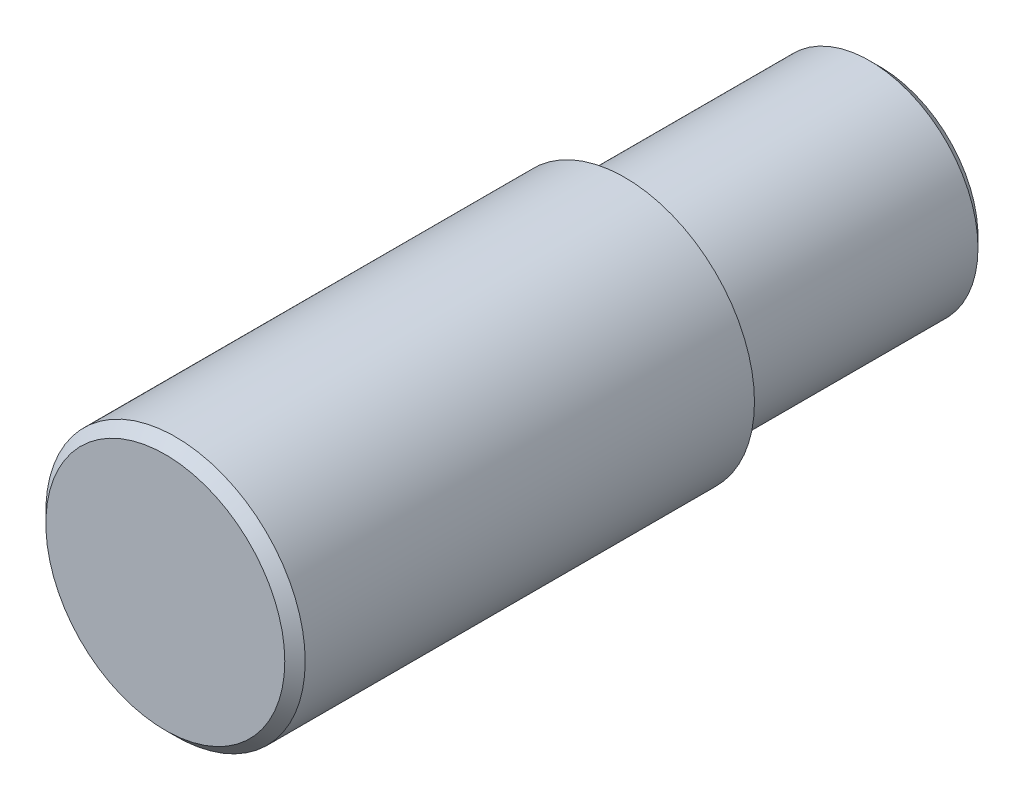
ISO-10303-21;
HEADER;
FILE_DESCRIPTION(('STEP AP214'),'2;1');
FILE_NAME('part.step','',(''),(''),'','','');
FILE_SCHEMA(('AUTOMOTIVE_DESIGN { 1 0 10303 214 1 1 1 1 }'));
ENDSEC;
DATA;
#1=APPLICATION_CONTEXT('core data for automotive mechanical design processes');
#2=APPLICATION_PROTOCOL_DEFINITION('international standard','automotive_design',2000,#1);
#3=PRODUCT_CONTEXT('',#1,'mechanical');
#4=PRODUCT('Part','Part','',(#3));
#5=PRODUCT_RELATED_PRODUCT_CATEGORY('part','',(#4));
#6=PRODUCT_DEFINITION_FORMATION('','',#4);
#7=PRODUCT_DEFINITION_CONTEXT('part definition',#1,'design');
#8=PRODUCT_DEFINITION('design','',#6,#7);
#9=PRODUCT_DEFINITION_SHAPE('','',#8);
#10=(LENGTH_UNIT() NAMED_UNIT(*) SI_UNIT(.MILLI.,.METRE.));
#11=(NAMED_UNIT(*) PLANE_ANGLE_UNIT() SI_UNIT($,.RADIAN.));
#12=(NAMED_UNIT(*) SI_UNIT($,.STERADIAN.) SOLID_ANGLE_UNIT());
#13=UNCERTAINTY_MEASURE_WITH_UNIT(LENGTH_MEASURE(1.E-05),#10,'distance_accuracy_value','');
#14=(GEOMETRIC_REPRESENTATION_CONTEXT(3) GLOBAL_UNCERTAINTY_ASSIGNED_CONTEXT((#13)) GLOBAL_UNIT_ASSIGNED_CONTEXT((#10,
#11,#12)) REPRESENTATION_CONTEXT('',''));
#15=CARTESIAN_POINT('',(0.,0.,0.));
#16=DIRECTION('',(0.,0.,1.));
#17=DIRECTION('',(1.,0.,0.));
#18=AXIS2_PLACEMENT_3D('',#15,#16,#17);
#19=CARTESIAN_POINT('',(0.,0.,45.));
#20=DIRECTION('',(0.,0.,-1.));
#21=DIRECTION('',(-1.,0.,0.));
#22=AXIS2_PLACEMENT_3D('',#19,#20,#21);
#23=CYLINDRICAL_SURFACE('',#22,12.7);
#24=CARTESIAN_POINT('',(0.,0.,44.));
#25=DIRECTION('',(0.,0.,1.));
#26=DIRECTION('',(1.,0.,0.));
#27=AXIS2_PLACEMENT_3D('',#24,#25,#26);
#28=CIRCLE('',#27,12.7);
#29=CARTESIAN_POINT('',(12.7,0.,44.));
#30=VERTEX_POINT('',#29);
#31=EDGE_CURVE('E10',#30,#30,#28,.F.);
#32=ORIENTED_EDGE('',*,*,#31,.T.);
#33=EDGE_LOOP('',(#32));
#34=FACE_BOUND('',#33,.T.);
#35=CARTESIAN_POINT('',(0.,0.,0.));
#36=DIRECTION('',(0.,0.,1.));
#37=DIRECTION('',(1.,0.,0.));
#38=AXIS2_PLACEMENT_3D('',#35,#36,#37);
#39=CIRCLE('',#38,12.7);
#40=CARTESIAN_POINT('',(12.7,0.,0.));
#41=VERTEX_POINT('',#40);
#42=EDGE_CURVE('E72',#41,#41,#39,.T.);
#43=ORIENTED_EDGE('',*,*,#42,.T.);
#44=EDGE_LOOP('',(#43));
#45=FACE_BOUND('',#44,.T.);
#46=ADVANCED_FACE('F45',(#34,#45),#23,.T.);
#47=CARTESIAN_POINT('',(0.,0.,45.));
#48=DIRECTION('',(0.,0.,1.));
#49=DIRECTION('',(1.,0.,0.));
#50=AXIS2_PLACEMENT_3D('',#47,#48,#49);
#51=PLANE('',#50);
#52=CARTESIAN_POINT('',(0.,0.,45.));
#53=DIRECTION('',(0.,0.,1.));
#54=DIRECTION('',(1.,0.,0.));
#55=AXIS2_PLACEMENT_3D('',#52,#53,#54);
#56=CIRCLE('',#55,11.7000000000001);
#57=CARTESIAN_POINT('',(11.7000000000001,0.,45.));
#58=VERTEX_POINT('',#57);
#59=EDGE_CURVE('E53',#58,#58,#56,.T.);
#60=ORIENTED_EDGE('',*,*,#59,.T.);
#61=EDGE_LOOP('',(#60));
#62=FACE_BOUND('',#61,.T.);
#63=ADVANCED_FACE('F80',(#62),#51,.T.);
#64=CARTESIAN_POINT('',(0.,0.,0.));
#65=DIRECTION('',(0.,0.,1.));
#66=DIRECTION('',(1.,0.,0.));
#67=AXIS2_PLACEMENT_3D('',#64,#65,#66);
#68=PLANE('',#67);
#69=CARTESIAN_POINT('',(0.,0.,0.));
#70=DIRECTION('',(0.,0.,1.));
#71=DIRECTION('',(1.,0.,0.));
#72=AXIS2_PLACEMENT_3D('',#69,#70,#71);
#73=CIRCLE('',#72,11.59);
#74=CARTESIAN_POINT('',(11.59,0.,0.));
#75=VERTEX_POINT('',#74);
#76=EDGE_CURVE('E66',#75,#75,#73,.T.);
#77=ORIENTED_EDGE('',*,*,#76,.T.);
#78=EDGE_LOOP('',(#77));
#79=FACE_BOUND('',#78,.T.);
#80=ORIENTED_EDGE('',*,*,#42,.F.);
#81=EDGE_LOOP('',(#80));
#82=FACE_BOUND('',#81,.T.);
#83=ADVANCED_FACE('F77',(#79,#82),#68,.F.);
#84=CARTESIAN_POINT('',(0.,0.,-25.));
#85=DIRECTION('',(0.,0.,1.));
#86=DIRECTION('',(1.,0.,0.));
#87=AXIS2_PLACEMENT_3D('',#84,#85,#86);
#88=CYLINDRICAL_SURFACE('',#87,10.59);
#89=CARTESIAN_POINT('',(0.,0.,-24.));
#90=DIRECTION('',(0.,0.,-1.));
#91=DIRECTION('',(-1.,0.,0.));
#92=AXIS2_PLACEMENT_3D('',#89,#90,#91);
#93=CIRCLE('',#92,10.59);
#94=CARTESIAN_POINT('',(-10.59,0.,-24.));
#95=VERTEX_POINT('',#94);
#96=EDGE_CURVE('E57',#95,#95,#93,.F.);
#97=ORIENTED_EDGE('',*,*,#96,.T.);
#98=EDGE_LOOP('',(#97));
#99=FACE_BOUND('',#98,.T.);
#100=CARTESIAN_POINT('',(0.,0.,-1.));
#101=DIRECTION('',(0.,0.,1.));
#102=DIRECTION('',(1.,0.,0.));
#103=AXIS2_PLACEMENT_3D('',#100,#101,#102);
#104=CIRCLE('',#103,10.59);
#105=CARTESIAN_POINT('',(10.59,0.,-1.));
#106=VERTEX_POINT('',#105);
#107=EDGE_CURVE('E69',#106,#106,#104,.F.);
#108=ORIENTED_EDGE('',*,*,#107,.T.);
#109=EDGE_LOOP('',(#108));
#110=FACE_BOUND('',#109,.T.);
#111=ADVANCED_FACE('F79',(#99,#110),#88,.T.);
#112=CARTESIAN_POINT('',(0.,0.,-25.));
#113=DIRECTION('',(0.,0.,-1.));
#114=DIRECTION('',(-1.,0.,0.));
#115=AXIS2_PLACEMENT_3D('',#112,#113,#114);
#116=PLANE('',#115);
#117=CARTESIAN_POINT('',(0.,0.,-25.));
#118=DIRECTION('',(0.,0.,-1.));
#119=DIRECTION('',(-1.,0.,0.));
#120=AXIS2_PLACEMENT_3D('',#117,#118,#119);
#121=CIRCLE('',#120,9.58999999999999);
#122=CARTESIAN_POINT('',(-9.58999999999999,0.,-25.));
#123=VERTEX_POINT('',#122);
#124=EDGE_CURVE('E61',#123,#123,#121,.T.);
#125=ORIENTED_EDGE('',*,*,#124,.T.);
#126=EDGE_LOOP('',(#125));
#127=FACE_BOUND('',#126,.T.);
#128=ADVANCED_FACE('F87',(#127),#116,.T.);
#129=CARTESIAN_POINT('',(0.,0.,-1.));
#130=DIRECTION('',(0.,0.,1.));
#131=DIRECTION('',(1.,0.,0.));
#132=AXIS2_PLACEMENT_3D('',#129,#130,#131);
#133=TOROIDAL_SURFACE('',#132,11.59,1.);
#134=ORIENTED_EDGE('',*,*,#76,.F.);
#135=EDGE_LOOP('',(#134));
#136=FACE_BOUND('',#135,.T.);
#137=ORIENTED_EDGE('',*,*,#107,.F.);
#138=EDGE_LOOP('',(#137));
#139=FACE_BOUND('',#138,.T.);
#140=ADVANCED_FACE('F96',(#136,#139),#133,.F.);
#141=CARTESIAN_POINT('',(0.,0.,-25.));
#142=DIRECTION('',(0.,0.,1.));
#143=DIRECTION('',(1.,0.,0.));
#144=AXIS2_PLACEMENT_3D('',#141,#142,#143);
#145=CONICAL_SURFACE('',#144,9.58999999999999,0.785398163397445);
#146=ORIENTED_EDGE('',*,*,#96,.F.);
#147=EDGE_LOOP('',(#146));
#148=FACE_BOUND('',#147,.T.);
#149=ORIENTED_EDGE('',*,*,#124,.F.);
#150=EDGE_LOOP('',(#149));
#151=FACE_BOUND('',#150,.T.);
#152=ADVANCED_FACE('F98',(#148,#151),#145,.T.);
#153=CARTESIAN_POINT('',(0.,0.,45.));
#154=DIRECTION('',(0.,0.,-1.));
#155=DIRECTION('',(-1.,0.,0.));
#156=AXIS2_PLACEMENT_3D('',#153,#154,#155);
#157=CONICAL_SURFACE('',#156,11.7000000000001,0.785398163397447);
#158=ORIENTED_EDGE('',*,*,#31,.F.);
#159=EDGE_LOOP('',(#158));
#160=FACE_BOUND('',#159,.T.);
#161=ORIENTED_EDGE('',*,*,#59,.F.);
#162=EDGE_LOOP('',(#161));
#163=FACE_BOUND('',#162,.T.);
#164=ADVANCED_FACE('F48',(#160,#163),#157,.T.);
#165=CLOSED_SHELL('',(#46,#63,#83,#111,#128,#140,#152,#164));
#166=MANIFOLD_SOLID_BREP('B2',#165);
#167=ADVANCED_BREP_SHAPE_REPRESENTATION('',(#18,#166),#14);
#168=SHAPE_DEFINITION_REPRESENTATION(#9,#167);
ENDSEC;
END-ISO-10303-21;
